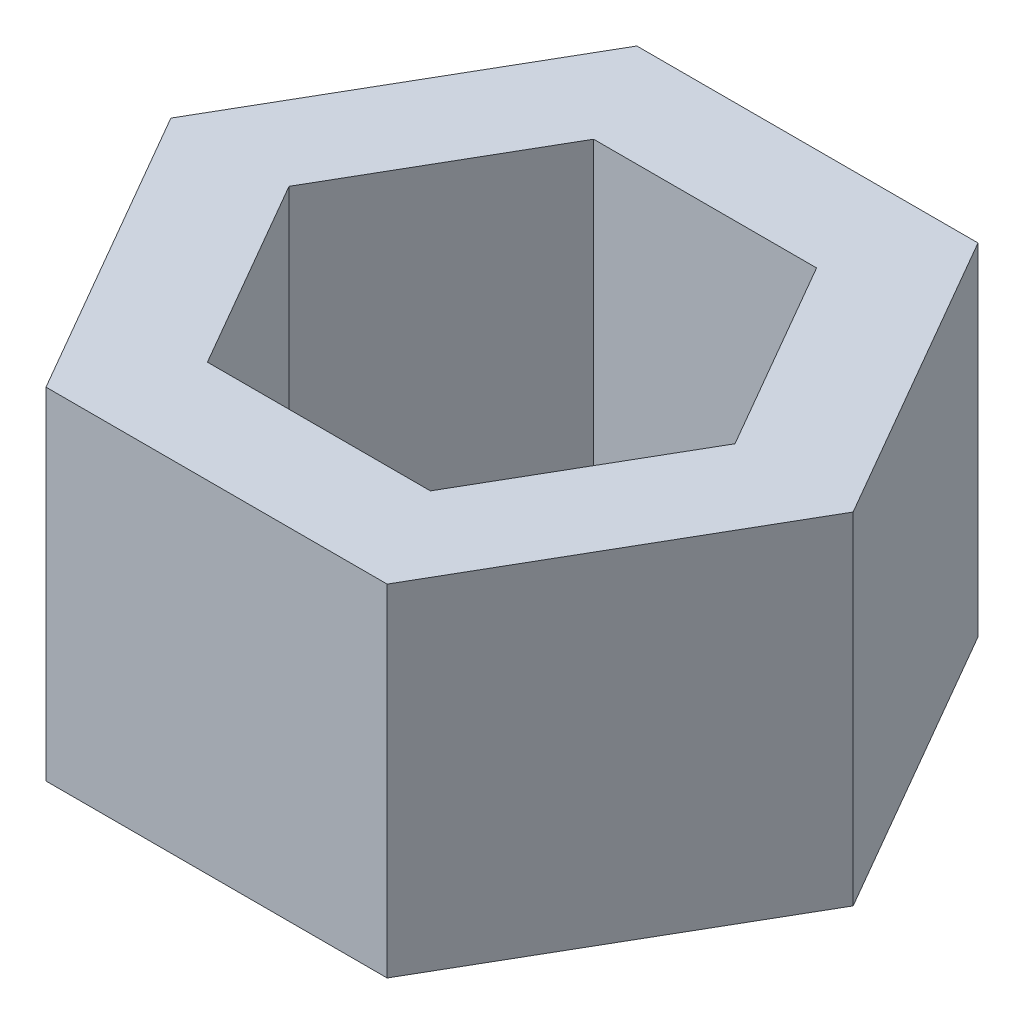
ISO-10303-21;
HEADER;
FILE_DESCRIPTION(('STEP AP214'),'2;1');
FILE_NAME('part.step','',(''),(''),'','','');
FILE_SCHEMA(('AUTOMOTIVE_DESIGN { 1 0 10303 214 1 1 1 1 }'));
ENDSEC;
DATA;
#1=APPLICATION_CONTEXT('core data for automotive mechanical design processes');
#2=APPLICATION_PROTOCOL_DEFINITION('international standard','automotive_design',2000,#1);
#3=PRODUCT_CONTEXT('',#1,'mechanical');
#4=PRODUCT('Part','Part','',(#3));
#5=PRODUCT_RELATED_PRODUCT_CATEGORY('part','',(#4));
#6=PRODUCT_DEFINITION_FORMATION('','',#4);
#7=PRODUCT_DEFINITION_CONTEXT('part definition',#1,'design');
#8=PRODUCT_DEFINITION('design','',#6,#7);
#9=PRODUCT_DEFINITION_SHAPE('','',#8);
#10=(LENGTH_UNIT() NAMED_UNIT(*) SI_UNIT(.MILLI.,.METRE.));
#11=(NAMED_UNIT(*) PLANE_ANGLE_UNIT() SI_UNIT($,.RADIAN.));
#12=(NAMED_UNIT(*) SI_UNIT($,.STERADIAN.) SOLID_ANGLE_UNIT());
#13=UNCERTAINTY_MEASURE_WITH_UNIT(LENGTH_MEASURE(1.E-05),#10,'distance_accuracy_value','');
#14=(GEOMETRIC_REPRESENTATION_CONTEXT(3) GLOBAL_UNCERTAINTY_ASSIGNED_CONTEXT((#13)) GLOBAL_UNIT_ASSIGNED_CONTEXT((#10,
#11,#12)) REPRESENTATION_CONTEXT('',''));
#15=CARTESIAN_POINT('',(0.,0.,0.));
#16=DIRECTION('',(0.,0.,1.));
#17=DIRECTION('',(1.,0.,0.));
#18=AXIS2_PLACEMENT_3D('',#15,#16,#17);
#19=CARTESIAN_POINT('',(-50.,50.,0.));
#20=DIRECTION('',(0.866025403784438,0.,-0.5));
#21=DIRECTION('',(-0.5,0.,-0.866025403784439));
#22=AXIS2_PLACEMENT_3D('',#19,#20,#21);
#23=PLANE('',#22);
#24=DIRECTION('',(0.5,0.,0.866025403784438));
#25=VECTOR('',#24,1.);
#26=CARTESIAN_POINT('',(-50.,0.,0.));
#27=LINE('',#26,#25);
#28=CARTESIAN_POINT('',(-50.,0.,0.));
#29=VERTEX_POINT('',#28);
#30=CARTESIAN_POINT('',(-25.,0.,43.3012701892219));
#31=VERTEX_POINT('',#30);
#32=EDGE_CURVE('E166',#29,#31,#27,.T.);
#33=ORIENTED_EDGE('',*,*,#32,.T.);
#34=DIRECTION('',(0.,-1.,0.));
#35=VECTOR('',#34,1.);
#36=CARTESIAN_POINT('',(-25.,50.,43.3012701892219));
#37=LINE('',#36,#35);
#38=CARTESIAN_POINT('',(-25.,50.,43.3012701892219));
#39=VERTEX_POINT('',#38);
#40=EDGE_CURVE('E11',#39,#31,#37,.T.);
#41=ORIENTED_EDGE('',*,*,#40,.F.);
#42=DIRECTION('',(0.5,0.,0.866025403784438));
#43=VECTOR('',#42,1.);
#44=CARTESIAN_POINT('',(-50.,50.,0.));
#45=LINE('',#44,#43);
#46=CARTESIAN_POINT('',(-50.,50.,0.));
#47=VERTEX_POINT('',#46);
#48=EDGE_CURVE('E174',#47,#39,#45,.T.);
#49=ORIENTED_EDGE('',*,*,#48,.F.);
#50=DIRECTION('',(0.,-1.,0.));
#51=VECTOR('',#50,1.);
#52=CARTESIAN_POINT('',(-50.,50.,0.));
#53=LINE('',#52,#51);
#54=EDGE_CURVE('E188',#47,#29,#53,.T.);
#55=ORIENTED_EDGE('',*,*,#54,.T.);
#56=EDGE_LOOP('',(#33,#41,#49,#55));
#57=FACE_BOUND('',#56,.T.);
#58=ADVANCED_FACE('F33',(#57),#23,.F.);
#59=CARTESIAN_POINT('',(-25.,50.,43.3012701892219));
#60=DIRECTION('',(0.,0.,-1.));
#61=DIRECTION('',(-1.,0.,0.));
#62=AXIS2_PLACEMENT_3D('',#59,#60,#61);
#63=PLANE('',#62);
#64=DIRECTION('',(1.,0.,0.));
#65=VECTOR('',#64,1.);
#66=CARTESIAN_POINT('',(-25.,0.,43.3012701892219));
#67=LINE('',#66,#65);
#68=CARTESIAN_POINT('',(25.,0.,43.3012701892219));
#69=VERTEX_POINT('',#68);
#70=EDGE_CURVE('E191',#31,#69,#67,.T.);
#71=ORIENTED_EDGE('',*,*,#70,.T.);
#72=DIRECTION('',(0.,-1.,0.));
#73=VECTOR('',#72,1.);
#74=CARTESIAN_POINT('',(25.,50.,43.3012701892219));
#75=LINE('',#74,#73);
#76=CARTESIAN_POINT('',(25.,50.,43.3012701892219));
#77=VERTEX_POINT('',#76);
#78=EDGE_CURVE('E40',#77,#69,#75,.T.);
#79=ORIENTED_EDGE('',*,*,#78,.F.);
#80=DIRECTION('',(1.,0.,0.));
#81=VECTOR('',#80,1.);
#82=CARTESIAN_POINT('',(-25.,50.,43.3012701892219));
#83=LINE('',#82,#81);
#84=EDGE_CURVE('E177',#39,#77,#83,.T.);
#85=ORIENTED_EDGE('',*,*,#84,.F.);
#86=ORIENTED_EDGE('',*,*,#40,.T.);
#87=EDGE_LOOP('',(#71,#79,#85,#86));
#88=FACE_BOUND('',#87,.T.);
#89=ADVANCED_FACE('F236',(#88),#63,.F.);
#90=CARTESIAN_POINT('',(25.,50.,43.3012701892219));
#91=DIRECTION('',(-0.866025403784439,0.,-0.5));
#92=DIRECTION('',(-0.5,0.,0.866025403784439));
#93=AXIS2_PLACEMENT_3D('',#90,#91,#92);
#94=PLANE('',#93);
#95=DIRECTION('',(0.5,0.,-0.866025403784439));
#96=VECTOR('',#95,1.);
#97=CARTESIAN_POINT('',(25.,0.,43.3012701892219));
#98=LINE('',#97,#96);
#99=CARTESIAN_POINT('',(50.,0.,0.));
#100=VERTEX_POINT('',#99);
#101=EDGE_CURVE('E193',#69,#100,#98,.T.);
#102=ORIENTED_EDGE('',*,*,#101,.T.);
#103=DIRECTION('',(0.,-1.,0.));
#104=VECTOR('',#103,1.);
#105=CARTESIAN_POINT('',(50.,50.,0.));
#106=LINE('',#105,#104);
#107=CARTESIAN_POINT('',(50.,50.,0.));
#108=VERTEX_POINT('',#107);
#109=EDGE_CURVE('E208',#108,#100,#106,.T.);
#110=ORIENTED_EDGE('',*,*,#109,.F.);
#111=DIRECTION('',(0.5,0.,-0.866025403784439));
#112=VECTOR('',#111,1.);
#113=CARTESIAN_POINT('',(25.,50.,43.3012701892219));
#114=LINE('',#113,#112);
#115=EDGE_CURVE('E180',#77,#108,#114,.T.);
#116=ORIENTED_EDGE('',*,*,#115,.F.);
#117=ORIENTED_EDGE('',*,*,#78,.T.);
#118=EDGE_LOOP('',(#102,#110,#116,#117));
#119=FACE_BOUND('',#118,.T.);
#120=ADVANCED_FACE('F215',(#119),#94,.F.);
#121=CARTESIAN_POINT('',(50.,50.,0.));
#122=DIRECTION('',(-0.866025403784438,0.,0.5));
#123=DIRECTION('',(0.5,0.,0.866025403784439));
#124=AXIS2_PLACEMENT_3D('',#121,#122,#123);
#125=PLANE('',#124);
#126=DIRECTION('',(-0.5,0.,-0.866025403784438));
#127=VECTOR('',#126,1.);
#128=CARTESIAN_POINT('',(50.,0.,0.));
#129=LINE('',#128,#127);
#130=CARTESIAN_POINT('',(25.,0.,-43.3012701892219));
#131=VERTEX_POINT('',#130);
#132=EDGE_CURVE('E195',#100,#131,#129,.T.);
#133=ORIENTED_EDGE('',*,*,#132,.T.);
#134=DIRECTION('',(0.,-1.,0.));
#135=VECTOR('',#134,1.);
#136=CARTESIAN_POINT('',(25.,50.,-43.3012701892219));
#137=LINE('',#136,#135);
#138=CARTESIAN_POINT('',(25.,50.,-43.3012701892219));
#139=VERTEX_POINT('',#138);
#140=EDGE_CURVE('E205',#139,#131,#137,.T.);
#141=ORIENTED_EDGE('',*,*,#140,.F.);
#142=DIRECTION('',(-0.5,0.,-0.866025403784438));
#143=VECTOR('',#142,1.);
#144=CARTESIAN_POINT('',(50.,50.,0.));
#145=LINE('',#144,#143);
#146=EDGE_CURVE('E182',#108,#139,#145,.T.);
#147=ORIENTED_EDGE('',*,*,#146,.F.);
#148=ORIENTED_EDGE('',*,*,#109,.T.);
#149=EDGE_LOOP('',(#133,#141,#147,#148));
#150=FACE_BOUND('',#149,.T.);
#151=ADVANCED_FACE('F224',(#150),#125,.F.);
#152=CARTESIAN_POINT('',(25.,50.,-43.3012701892219));
#153=DIRECTION('',(0.,0.,1.));
#154=DIRECTION('',(1.,0.,0.));
#155=AXIS2_PLACEMENT_3D('',#152,#153,#154);
#156=PLANE('',#155);
#157=DIRECTION('',(-1.,0.,0.));
#158=VECTOR('',#157,1.);
#159=CARTESIAN_POINT('',(25.,0.,-43.3012701892219));
#160=LINE('',#159,#158);
#161=CARTESIAN_POINT('',(-25.,0.,-43.3012701892219));
#162=VERTEX_POINT('',#161);
#163=EDGE_CURVE('E197',#131,#162,#160,.T.);
#164=ORIENTED_EDGE('',*,*,#163,.T.);
#165=DIRECTION('',(0.,-1.,0.));
#166=VECTOR('',#165,1.);
#167=CARTESIAN_POINT('',(-25.,50.,-43.3012701892219));
#168=LINE('',#167,#166);
#169=CARTESIAN_POINT('',(-25.,50.,-43.3012701892219));
#170=VERTEX_POINT('',#169);
#171=EDGE_CURVE('E202',#170,#162,#168,.T.);
#172=ORIENTED_EDGE('',*,*,#171,.F.);
#173=DIRECTION('',(-1.,0.,0.));
#174=VECTOR('',#173,1.);
#175=CARTESIAN_POINT('',(25.,50.,-43.3012701892219));
#176=LINE('',#175,#174);
#177=EDGE_CURVE('E184',#139,#170,#176,.T.);
#178=ORIENTED_EDGE('',*,*,#177,.F.);
#179=ORIENTED_EDGE('',*,*,#140,.T.);
#180=EDGE_LOOP('',(#164,#172,#178,#179));
#181=FACE_BOUND('',#180,.T.);
#182=ADVANCED_FACE('F228',(#181),#156,.F.);
#183=CARTESIAN_POINT('',(-25.,50.,-43.3012701892219));
#184=DIRECTION('',(0.866025403784439,0.,0.5));
#185=DIRECTION('',(0.5,0.,-0.866025403784439));
#186=AXIS2_PLACEMENT_3D('',#183,#184,#185);
#187=PLANE('',#186);
#188=DIRECTION('',(-0.5,0.,0.866025403784439));
#189=VECTOR('',#188,1.);
#190=CARTESIAN_POINT('',(-25.,0.,-43.3012701892219));
#191=LINE('',#190,#189);
#192=EDGE_CURVE('E178',#162,#29,#191,.T.);
#193=ORIENTED_EDGE('',*,*,#192,.T.);
#194=ORIENTED_EDGE('',*,*,#54,.F.);
#195=DIRECTION('',(-0.5,0.,0.866025403784439));
#196=VECTOR('',#195,1.);
#197=CARTESIAN_POINT('',(-25.,50.,-43.3012701892219));
#198=LINE('',#197,#196);
#199=EDGE_CURVE('E186',#170,#47,#198,.T.);
#200=ORIENTED_EDGE('',*,*,#199,.F.);
#201=ORIENTED_EDGE('',*,*,#171,.T.);
#202=EDGE_LOOP('',(#193,#194,#200,#201));
#203=FACE_BOUND('',#202,.T.);
#204=ADVANCED_FACE('F239',(#203),#187,.F.);
#205=CARTESIAN_POINT('',(0.,50.,0.));
#206=DIRECTION('',(0.,1.,0.));
#207=DIRECTION('',(0.,0.,1.));
#208=AXIS2_PLACEMENT_3D('',#205,#206,#207);
#209=PLANE('',#208);
#210=DIRECTION('',(-0.5,0.,0.866025403784439));
#211=VECTOR('',#210,1.);
#212=CARTESIAN_POINT('',(-16.3397459621556,50.,-28.3012701892219));
#213=LINE('',#212,#211);
#214=CARTESIAN_POINT('',(-16.3397459621556,50.,-28.3012701892219));
#215=VERTEX_POINT('',#214);
#216=CARTESIAN_POINT('',(-32.6794919243112,50.,0.));
#217=VERTEX_POINT('',#216);
#218=EDGE_CURVE('E47',#215,#217,#213,.T.);
#219=ORIENTED_EDGE('',*,*,#218,.F.);
#220=DIRECTION('',(-1.,0.,0.));
#221=VECTOR('',#220,1.);
#222=CARTESIAN_POINT('',(16.3397459621556,50.,-28.3012701892219));
#223=LINE('',#222,#221);
#224=CARTESIAN_POINT('',(16.3397459621556,50.,-28.3012701892219));
#225=VERTEX_POINT('',#224);
#226=EDGE_CURVE('E140',#225,#215,#223,.T.);
#227=ORIENTED_EDGE('',*,*,#226,.F.);
#228=DIRECTION('',(-0.5,0.,-0.866025403784438));
#229=VECTOR('',#228,1.);
#230=CARTESIAN_POINT('',(32.6794919243112,50.,0.));
#231=LINE('',#230,#229);
#232=CARTESIAN_POINT('',(32.6794919243112,50.,0.));
#233=VERTEX_POINT('',#232);
#234=EDGE_CURVE('E143',#233,#225,#231,.T.);
#235=ORIENTED_EDGE('',*,*,#234,.F.);
#236=DIRECTION('',(0.5,0.,-0.866025403784439));
#237=VECTOR('',#236,1.);
#238=CARTESIAN_POINT('',(16.3397459621556,50.,28.3012701892219));
#239=LINE('',#238,#237);
#240=CARTESIAN_POINT('',(16.3397459621556,50.,28.3012701892219));
#241=VERTEX_POINT('',#240);
#242=EDGE_CURVE('E159',#241,#233,#239,.T.);
#243=ORIENTED_EDGE('',*,*,#242,.F.);
#244=DIRECTION('',(1.,0.,0.));
#245=VECTOR('',#244,1.);
#246=CARTESIAN_POINT('',(-16.3397459621556,50.,28.3012701892219));
#247=LINE('',#246,#245);
#248=CARTESIAN_POINT('',(-16.3397459621556,50.,28.3012701892219));
#249=VERTEX_POINT('',#248);
#250=EDGE_CURVE('E156',#249,#241,#247,.T.);
#251=ORIENTED_EDGE('',*,*,#250,.F.);
#252=DIRECTION('',(0.5,0.,0.866025403784439));
#253=VECTOR('',#252,1.);
#254=CARTESIAN_POINT('',(-32.6794919243112,50.,0.));
#255=LINE('',#254,#253);
#256=EDGE_CURVE('E154',#217,#249,#255,.T.);
#257=ORIENTED_EDGE('',*,*,#256,.F.);
#258=EDGE_LOOP('',(#219,#227,#235,#243,#251,#257));
#259=FACE_BOUND('',#258,.T.);
#260=ORIENTED_EDGE('',*,*,#48,.T.);
#261=ORIENTED_EDGE('',*,*,#84,.T.);
#262=ORIENTED_EDGE('',*,*,#115,.T.);
#263=ORIENTED_EDGE('',*,*,#146,.T.);
#264=ORIENTED_EDGE('',*,*,#177,.T.);
#265=ORIENTED_EDGE('',*,*,#199,.T.);
#266=EDGE_LOOP('',(#260,#261,#262,#263,#264,#265));
#267=FACE_BOUND('',#266,.T.);
#268=ADVANCED_FACE('F232',(#259,#267),#209,.T.);
#269=CARTESIAN_POINT('',(0.,0.,0.));
#270=DIRECTION('',(0.,1.,0.));
#271=DIRECTION('',(0.,0.,1.));
#272=AXIS2_PLACEMENT_3D('',#269,#270,#271);
#273=PLANE('',#272);
#274=DIRECTION('',(-1.,0.,0.));
#275=VECTOR('',#274,1.);
#276=CARTESIAN_POINT('',(16.3397459621556,0.,-28.3012701892219));
#277=LINE('',#276,#275);
#278=CARTESIAN_POINT('',(16.3397459621556,0.,-28.3012701892219));
#279=VERTEX_POINT('',#278);
#280=CARTESIAN_POINT('',(-16.3397459621556,0.,-28.3012701892219));
#281=VERTEX_POINT('',#280);
#282=EDGE_CURVE('E129',#279,#281,#277,.T.);
#283=ORIENTED_EDGE('',*,*,#282,.T.);
#284=DIRECTION('',(-0.5,0.,0.866025403784439));
#285=VECTOR('',#284,1.);
#286=CARTESIAN_POINT('',(-16.3397459621556,0.,-28.3012701892219));
#287=LINE('',#286,#285);
#288=CARTESIAN_POINT('',(-32.6794919243112,0.,0.));
#289=VERTEX_POINT('',#288);
#290=EDGE_CURVE('E123',#281,#289,#287,.T.);
#291=ORIENTED_EDGE('',*,*,#290,.T.);
#292=DIRECTION('',(0.5,0.,0.866025403784439));
#293=VECTOR('',#292,1.);
#294=CARTESIAN_POINT('',(-32.6794919243112,0.,0.));
#295=LINE('',#294,#293);
#296=CARTESIAN_POINT('',(-16.3397459621556,0.,28.3012701892219));
#297=VERTEX_POINT('',#296);
#298=EDGE_CURVE('E132',#289,#297,#295,.T.);
#299=ORIENTED_EDGE('',*,*,#298,.T.);
#300=DIRECTION('',(1.,0.,0.));
#301=VECTOR('',#300,1.);
#302=CARTESIAN_POINT('',(-16.3397459621556,0.,28.3012701892219));
#303=LINE('',#302,#301);
#304=CARTESIAN_POINT('',(16.3397459621556,0.,28.3012701892219));
#305=VERTEX_POINT('',#304);
#306=EDGE_CURVE('E55',#297,#305,#303,.T.);
#307=ORIENTED_EDGE('',*,*,#306,.T.);
#308=DIRECTION('',(0.5,0.,-0.866025403784439));
#309=VECTOR('',#308,1.);
#310=CARTESIAN_POINT('',(16.3397459621556,0.,28.3012701892219));
#311=LINE('',#310,#309);
#312=CARTESIAN_POINT('',(32.6794919243112,0.,0.));
#313=VERTEX_POINT('',#312);
#314=EDGE_CURVE('E147',#305,#313,#311,.T.);
#315=ORIENTED_EDGE('',*,*,#314,.T.);
#316=DIRECTION('',(-0.5,0.,-0.866025403784438));
#317=VECTOR('',#316,1.);
#318=CARTESIAN_POINT('',(32.6794919243112,0.,0.));
#319=LINE('',#318,#317);
#320=EDGE_CURVE('E150',#313,#279,#319,.T.);
#321=ORIENTED_EDGE('',*,*,#320,.T.);
#322=EDGE_LOOP('',(#283,#291,#299,#307,#315,#321));
#323=FACE_BOUND('',#322,.T.);
#324=ORIENTED_EDGE('',*,*,#32,.F.);
#325=ORIENTED_EDGE('',*,*,#192,.F.);
#326=ORIENTED_EDGE('',*,*,#163,.F.);
#327=ORIENTED_EDGE('',*,*,#132,.F.);
#328=ORIENTED_EDGE('',*,*,#101,.F.);
#329=ORIENTED_EDGE('',*,*,#70,.F.);
#330=EDGE_LOOP('',(#324,#325,#326,#327,#328,#329));
#331=FACE_BOUND('',#330,.T.);
#332=ADVANCED_FACE('F136',(#323,#331),#273,.F.);
#333=CARTESIAN_POINT('',(-16.3397459621556,0.,-28.3012701892219));
#334=DIRECTION('',(-0.866025403784439,0.,-0.5));
#335=DIRECTION('',(-0.5,0.,0.866025403784439));
#336=AXIS2_PLACEMENT_3D('',#333,#334,#335);
#337=PLANE('',#336);
#338=ORIENTED_EDGE('',*,*,#218,.T.);
#339=DIRECTION('',(0.,1.,0.));
#340=VECTOR('',#339,1.);
#341=CARTESIAN_POINT('',(-32.6794919243112,0.,0.));
#342=LINE('',#341,#340);
#343=EDGE_CURVE('E119',#289,#217,#342,.T.);
#344=ORIENTED_EDGE('',*,*,#343,.F.);
#345=ORIENTED_EDGE('',*,*,#290,.F.);
#346=DIRECTION('',(0.,1.,0.));
#347=VECTOR('',#346,1.);
#348=CARTESIAN_POINT('',(-16.3397459621556,0.,-28.3012701892219));
#349=LINE('',#348,#347);
#350=EDGE_CURVE('E164',#281,#215,#349,.T.);
#351=ORIENTED_EDGE('',*,*,#350,.T.);
#352=EDGE_LOOP('',(#338,#344,#345,#351));
#353=FACE_BOUND('',#352,.T.);
#354=ADVANCED_FACE('F121',(#353),#337,.F.);
#355=CARTESIAN_POINT('',(16.3397459621556,0.,-28.3012701892219));
#356=DIRECTION('',(0.,0.,-1.));
#357=DIRECTION('',(-1.,0.,0.));
#358=AXIS2_PLACEMENT_3D('',#355,#356,#357);
#359=PLANE('',#358);
#360=ORIENTED_EDGE('',*,*,#226,.T.);
#361=ORIENTED_EDGE('',*,*,#350,.F.);
#362=ORIENTED_EDGE('',*,*,#282,.F.);
#363=DIRECTION('',(0.,1.,0.));
#364=VECTOR('',#363,1.);
#365=CARTESIAN_POINT('',(16.3397459621556,0.,-28.3012701892219));
#366=LINE('',#365,#364);
#367=EDGE_CURVE('E167',#279,#225,#366,.T.);
#368=ORIENTED_EDGE('',*,*,#367,.T.);
#369=EDGE_LOOP('',(#360,#361,#362,#368));
#370=FACE_BOUND('',#369,.T.);
#371=ADVANCED_FACE('F294',(#370),#359,.F.);
#372=CARTESIAN_POINT('',(32.6794919243112,0.,0.));
#373=DIRECTION('',(0.866025403784438,0.,-0.5));
#374=DIRECTION('',(-0.5,0.,-0.866025403784438));
#375=AXIS2_PLACEMENT_3D('',#372,#373,#374);
#376=PLANE('',#375);
#377=ORIENTED_EDGE('',*,*,#234,.T.);
#378=ORIENTED_EDGE('',*,*,#367,.F.);
#379=ORIENTED_EDGE('',*,*,#320,.F.);
#380=DIRECTION('',(0.,1.,0.));
#381=VECTOR('',#380,1.);
#382=CARTESIAN_POINT('',(32.6794919243112,0.,0.));
#383=LINE('',#382,#381);
#384=EDGE_CURVE('E169',#313,#233,#383,.T.);
#385=ORIENTED_EDGE('',*,*,#384,.T.);
#386=EDGE_LOOP('',(#377,#378,#379,#385));
#387=FACE_BOUND('',#386,.T.);
#388=ADVANCED_FACE('F303',(#387),#376,.F.);
#389=CARTESIAN_POINT('',(16.3397459621556,0.,28.3012701892219));
#390=DIRECTION('',(0.866025403784439,0.,0.5));
#391=DIRECTION('',(0.5,0.,-0.866025403784439));
#392=AXIS2_PLACEMENT_3D('',#389,#390,#391);
#393=PLANE('',#392);
#394=ORIENTED_EDGE('',*,*,#242,.T.);
#395=ORIENTED_EDGE('',*,*,#384,.F.);
#396=ORIENTED_EDGE('',*,*,#314,.F.);
#397=DIRECTION('',(0.,1.,0.));
#398=VECTOR('',#397,1.);
#399=CARTESIAN_POINT('',(16.3397459621556,0.,28.3012701892219));
#400=LINE('',#399,#398);
#401=EDGE_CURVE('E171',#305,#241,#400,.T.);
#402=ORIENTED_EDGE('',*,*,#401,.T.);
#403=EDGE_LOOP('',(#394,#395,#396,#402));
#404=FACE_BOUND('',#403,.T.);
#405=ADVANCED_FACE('F313',(#404),#393,.F.);
#406=CARTESIAN_POINT('',(-16.3397459621556,0.,28.3012701892219));
#407=DIRECTION('',(0.,0.,1.));
#408=DIRECTION('',(1.,0.,0.));
#409=AXIS2_PLACEMENT_3D('',#406,#407,#408);
#410=PLANE('',#409);
#411=ORIENTED_EDGE('',*,*,#250,.T.);
#412=ORIENTED_EDGE('',*,*,#401,.F.);
#413=ORIENTED_EDGE('',*,*,#306,.F.);
#414=DIRECTION('',(0.,1.,0.));
#415=VECTOR('',#414,1.);
#416=CARTESIAN_POINT('',(-16.3397459621556,0.,28.3012701892219));
#417=LINE('',#416,#415);
#418=EDGE_CURVE('E128',#297,#249,#417,.T.);
#419=ORIENTED_EDGE('',*,*,#418,.T.);
#420=EDGE_LOOP('',(#411,#412,#413,#419));
#421=FACE_BOUND('',#420,.T.);
#422=ADVANCED_FACE('F323',(#421),#410,.F.);
#423=CARTESIAN_POINT('',(-32.6794919243112,0.,0.));
#424=DIRECTION('',(-0.866025403784439,0.,0.5));
#425=DIRECTION('',(0.5,0.,0.866025403784439));
#426=AXIS2_PLACEMENT_3D('',#423,#424,#425);
#427=PLANE('',#426);
#428=ORIENTED_EDGE('',*,*,#256,.T.);
#429=ORIENTED_EDGE('',*,*,#418,.F.);
#430=ORIENTED_EDGE('',*,*,#298,.F.);
#431=ORIENTED_EDGE('',*,*,#343,.T.);
#432=EDGE_LOOP('',(#428,#429,#430,#431));
#433=FACE_BOUND('',#432,.T.);
#434=ADVANCED_FACE('F133',(#433),#427,.F.);
#435=CLOSED_SHELL('',(#58,#89,#120,#151,#182,#204,#268,#332,#354,#371,#388,#405,#422,#434));
#436=MANIFOLD_SOLID_BREP('B2',#435);
#437=ADVANCED_BREP_SHAPE_REPRESENTATION('',(#18,#436),#14);
#438=SHAPE_DEFINITION_REPRESENTATION(#9,#437);
ENDSEC;
END-ISO-10303-21;
